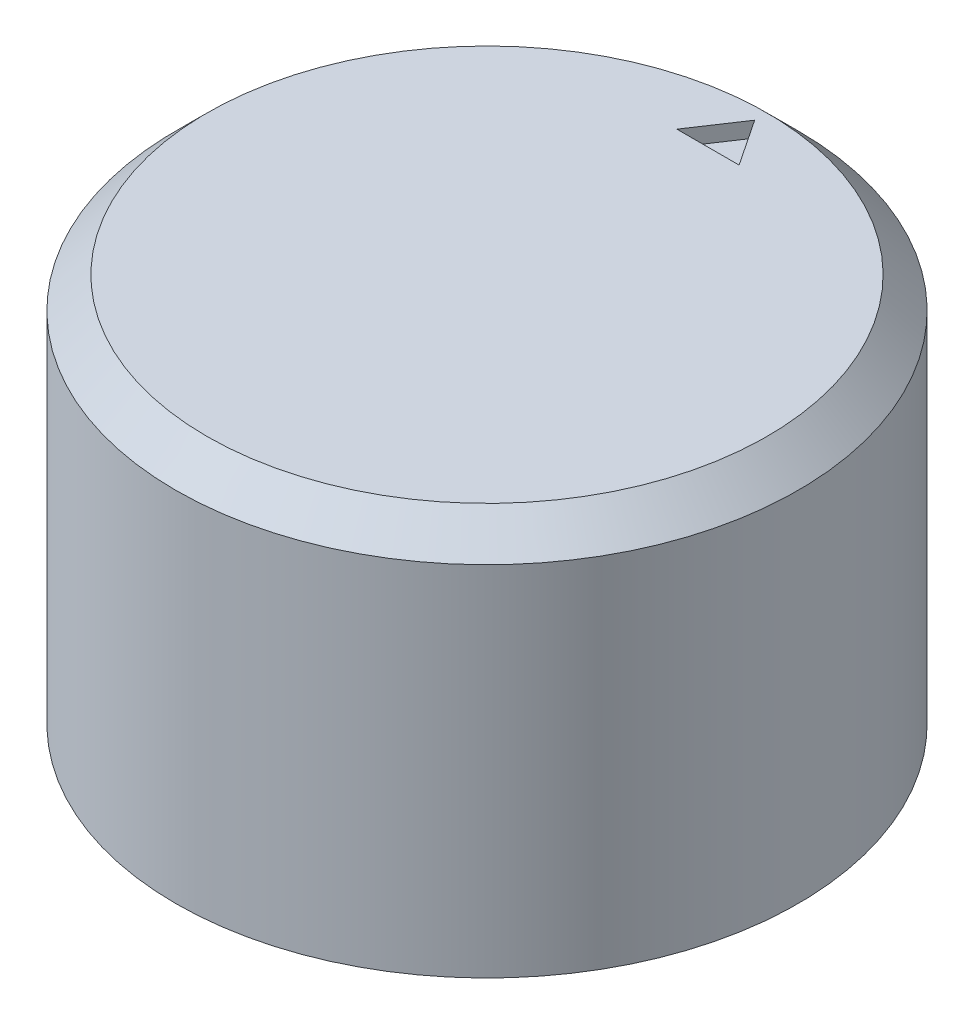
ISO-10303-21;
HEADER;
FILE_DESCRIPTION(('STEP AP214'),'2;1');
FILE_NAME('part.step','',(''),(''),'','','');
FILE_SCHEMA(('AUTOMOTIVE_DESIGN { 1 0 10303 214 1 1 1 1 }'));
ENDSEC;
DATA;
#1=APPLICATION_CONTEXT('core data for automotive mechanical design processes');
#2=APPLICATION_PROTOCOL_DEFINITION('international standard','automotive_design',2000,#1);
#3=PRODUCT_CONTEXT('',#1,'mechanical');
#4=PRODUCT('Part','Part','',(#3));
#5=PRODUCT_RELATED_PRODUCT_CATEGORY('part','',(#4));
#6=PRODUCT_DEFINITION_FORMATION('','',#4);
#7=PRODUCT_DEFINITION_CONTEXT('part definition',#1,'design');
#8=PRODUCT_DEFINITION('design','',#6,#7);
#9=PRODUCT_DEFINITION_SHAPE('','',#8);
#10=(LENGTH_UNIT() NAMED_UNIT(*) SI_UNIT(.MILLI.,.METRE.));
#11=(NAMED_UNIT(*) PLANE_ANGLE_UNIT() SI_UNIT($,.RADIAN.));
#12=(NAMED_UNIT(*) SI_UNIT($,.STERADIAN.) SOLID_ANGLE_UNIT());
#13=UNCERTAINTY_MEASURE_WITH_UNIT(LENGTH_MEASURE(1.E-05),#10,'distance_accuracy_value','');
#14=(GEOMETRIC_REPRESENTATION_CONTEXT(3) GLOBAL_UNCERTAINTY_ASSIGNED_CONTEXT((#13)) GLOBAL_UNIT_ASSIGNED_CONTEXT((#10,
#11,#12)) REPRESENTATION_CONTEXT('',''));
#15=CARTESIAN_POINT('',(0.,0.,0.));
#16=DIRECTION('',(0.,0.,1.));
#17=DIRECTION('',(1.,0.,0.));
#18=AXIS2_PLACEMENT_3D('',#15,#16,#17);
#19=CARTESIAN_POINT('',(0.,12.5,0.));
#20=DIRECTION('',(0.,-1.,0.));
#21=DIRECTION('',(0.,0.,-1.));
#22=AXIS2_PLACEMENT_3D('',#19,#20,#21);
#23=CYLINDRICAL_SURFACE('',#22,10.);
#24=CARTESIAN_POINT('',(0.,11.5,0.));
#25=DIRECTION('',(0.,1.,0.));
#26=DIRECTION('',(0.,0.,1.));
#27=AXIS2_PLACEMENT_3D('',#24,#25,#26);
#28=CIRCLE('',#27,10.);
#29=CARTESIAN_POINT('',(0.,11.5,10.));
#30=VERTEX_POINT('',#29);
#31=EDGE_CURVE('E11',#30,#30,#28,.F.);
#32=ORIENTED_EDGE('',*,*,#31,.T.);
#33=EDGE_LOOP('',(#32));
#34=FACE_BOUND('',#33,.T.);
#35=CARTESIAN_POINT('',(0.,0.,0.));
#36=DIRECTION('',(0.,1.,0.));
#37=DIRECTION('',(0.,0.,1.));
#38=AXIS2_PLACEMENT_3D('',#35,#36,#37);
#39=CIRCLE('',#38,10.);
#40=CARTESIAN_POINT('',(0.,0.,10.));
#41=VERTEX_POINT('',#40);
#42=EDGE_CURVE('E149',#41,#41,#39,.T.);
#43=ORIENTED_EDGE('',*,*,#42,.T.);
#44=EDGE_LOOP('',(#43));
#45=FACE_BOUND('',#44,.T.);
#46=ADVANCED_FACE('F44',(#34,#45),#23,.T.);
#47=CARTESIAN_POINT('',(0.,12.5,0.));
#48=DIRECTION('',(0.,1.,0.));
#49=DIRECTION('',(0.,0.,1.));
#50=AXIS2_PLACEMENT_3D('',#47,#48,#49);
#51=PLANE('',#50);
#52=CARTESIAN_POINT('',(0.,12.5,0.));
#53=DIRECTION('',(0.,1.,0.));
#54=DIRECTION('',(0.,0.,1.));
#55=AXIS2_PLACEMENT_3D('',#52,#53,#54);
#56=CIRCLE('',#55,8.99999999999999);
#57=CARTESIAN_POINT('',(0.,12.5,8.99999999999999));
#58=VERTEX_POINT('',#57);
#59=EDGE_CURVE('E54',#58,#58,#56,.T.);
#60=ORIENTED_EDGE('',*,*,#59,.T.);
#61=EDGE_LOOP('',(#60));
#62=FACE_BOUND('',#61,.T.);
#63=DIRECTION('',(1.,0.,0.));
#64=VECTOR('',#63,1.);
#65=CARTESIAN_POINT('',(1.,12.5,-7.1));
#66=LINE('',#65,#64);
#67=CARTESIAN_POINT('',(-1.,12.5,-7.1));
#68=VERTEX_POINT('',#67);
#69=CARTESIAN_POINT('',(1.,12.5,-7.1));
#70=VERTEX_POINT('',#69);
#71=EDGE_CURVE('E61',#68,#70,#66,.T.);
#72=ORIENTED_EDGE('',*,*,#71,.F.);
#73=DIRECTION('',(-0.554700196225229,0.,0.832050294337844));
#74=VECTOR('',#73,1.);
#75=CARTESIAN_POINT('',(-1.,12.5,-7.1));
#76=LINE('',#75,#74);
#77=CARTESIAN_POINT('',(0.,12.5,-8.6));
#78=VERTEX_POINT('',#77);
#79=EDGE_CURVE('E113',#78,#68,#76,.T.);
#80=ORIENTED_EDGE('',*,*,#79,.F.);
#81=DIRECTION('',(-0.554700196225229,0.,-0.832050294337844));
#82=VECTOR('',#81,1.);
#83=CARTESIAN_POINT('',(0.,12.5,-8.6));
#84=LINE('',#83,#82);
#85=EDGE_CURVE('E117',#70,#78,#84,.T.);
#86=ORIENTED_EDGE('',*,*,#85,.F.);
#87=EDGE_LOOP('',(#72,#80,#86));
#88=FACE_BOUND('',#87,.T.);
#89=ADVANCED_FACE('F158',(#62,#88),#51,.T.);
#90=CARTESIAN_POINT('',(0.,0.,0.));
#91=DIRECTION('',(0.,1.,0.));
#92=DIRECTION('',(0.,0.,1.));
#93=AXIS2_PLACEMENT_3D('',#90,#91,#92);
#94=PLANE('',#93);
#95=DIRECTION('',(-1.,0.,0.));
#96=VECTOR('',#95,1.);
#97=CARTESIAN_POINT('',(-2.59807621135332,0.,1.5));
#98=LINE('',#97,#96);
#99=CARTESIAN_POINT('',(2.59807621135332,0.,1.5));
#100=VERTEX_POINT('',#99);
#101=CARTESIAN_POINT('',(-2.59807621135332,0.,1.5));
#102=VERTEX_POINT('',#101);
#103=EDGE_CURVE('E136',#100,#102,#98,.T.);
#104=ORIENTED_EDGE('',*,*,#103,.F.);
#105=CARTESIAN_POINT('',(0.,0.,0.));
#106=DIRECTION('',(0.,-1.,0.));
#107=DIRECTION('',(0.,0.,-1.));
#108=AXIS2_PLACEMENT_3D('',#105,#106,#107);
#109=CIRCLE('',#108,3.);
#110=EDGE_CURVE('E69',#102,#100,#109,.T.);
#111=ORIENTED_EDGE('',*,*,#110,.F.);
#112=EDGE_LOOP('',(#104,#111));
#113=FACE_BOUND('',#112,.T.);
#114=ORIENTED_EDGE('',*,*,#42,.F.);
#115=EDGE_LOOP('',(#114));
#116=FACE_BOUND('',#115,.T.);
#117=ADVANCED_FACE('F174',(#113,#116),#94,.F.);
#118=CARTESIAN_POINT('',(0.,10.,0.));
#119=DIRECTION('',(0.,-1.,0.));
#120=DIRECTION('',(0.,0.,-1.));
#121=AXIS2_PLACEMENT_3D('',#118,#119,#120);
#122=CYLINDRICAL_SURFACE('',#121,3.);
#123=ORIENTED_EDGE('',*,*,#110,.T.);
#124=DIRECTION('',(0.,-1.,0.));
#125=VECTOR('',#124,1.);
#126=CARTESIAN_POINT('',(2.59807621135332,10.,1.5));
#127=LINE('',#126,#125);
#128=CARTESIAN_POINT('',(2.59807621135332,10.,1.5));
#129=VERTEX_POINT('',#128);
#130=EDGE_CURVE('E140',#129,#100,#127,.T.);
#131=ORIENTED_EDGE('',*,*,#130,.F.);
#132=CARTESIAN_POINT('',(0.,10.,0.));
#133=DIRECTION('',(0.,-1.,0.));
#134=DIRECTION('',(0.,0.,-1.));
#135=AXIS2_PLACEMENT_3D('',#132,#133,#134);
#136=CIRCLE('',#135,3.);
#137=CARTESIAN_POINT('',(-2.59807621135332,10.,1.5));
#138=VERTEX_POINT('',#137);
#139=EDGE_CURVE('E131',#138,#129,#136,.T.);
#140=ORIENTED_EDGE('',*,*,#139,.F.);
#141=DIRECTION('',(0.,-1.,0.));
#142=VECTOR('',#141,1.);
#143=CARTESIAN_POINT('',(-2.59807621135332,10.,1.5));
#144=LINE('',#143,#142);
#145=EDGE_CURVE('E146',#138,#102,#144,.T.);
#146=ORIENTED_EDGE('',*,*,#145,.T.);
#147=EDGE_LOOP('',(#123,#131,#140,#146));
#148=FACE_BOUND('',#147,.T.);
#149=ADVANCED_FACE('F179',(#148),#122,.F.);
#150=CARTESIAN_POINT('',(-2.59807621135332,10.,1.5));
#151=DIRECTION('',(0.,0.,1.));
#152=DIRECTION('',(1.,0.,0.));
#153=AXIS2_PLACEMENT_3D('',#150,#151,#152);
#154=PLANE('',#153);
#155=ORIENTED_EDGE('',*,*,#103,.T.);
#156=ORIENTED_EDGE('',*,*,#145,.F.);
#157=DIRECTION('',(-1.,0.,0.));
#158=VECTOR('',#157,1.);
#159=CARTESIAN_POINT('',(-2.59807621135332,10.,1.5));
#160=LINE('',#159,#158);
#161=EDGE_CURVE('E135',#129,#138,#160,.T.);
#162=ORIENTED_EDGE('',*,*,#161,.F.);
#163=ORIENTED_EDGE('',*,*,#130,.T.);
#164=EDGE_LOOP('',(#155,#156,#162,#163));
#165=FACE_BOUND('',#164,.T.);
#166=ADVANCED_FACE('F184',(#165),#154,.F.);
#167=CARTESIAN_POINT('',(0.,10.,0.));
#168=DIRECTION('',(0.,-1.,0.));
#169=DIRECTION('',(0.,0.,-1.));
#170=AXIS2_PLACEMENT_3D('',#167,#168,#169);
#171=PLANE('',#170);
#172=ORIENTED_EDGE('',*,*,#139,.T.);
#173=ORIENTED_EDGE('',*,*,#161,.T.);
#174=EDGE_LOOP('',(#172,#173));
#175=FACE_BOUND('',#174,.T.);
#176=ADVANCED_FACE('F187',(#175),#171,.T.);
#177=CARTESIAN_POINT('',(1.,12.,-7.1));
#178=DIRECTION('',(0.,0.,1.));
#179=DIRECTION('',(1.,0.,0.));
#180=AXIS2_PLACEMENT_3D('',#177,#178,#179);
#181=PLANE('',#180);
#182=ORIENTED_EDGE('',*,*,#71,.T.);
#183=DIRECTION('',(0.,1.,0.));
#184=VECTOR('',#183,1.);
#185=CARTESIAN_POINT('',(1.,12.,-7.1));
#186=LINE('',#185,#184);
#187=CARTESIAN_POINT('',(1.,12.,-7.1));
#188=VERTEX_POINT('',#187);
#189=EDGE_CURVE('E91',#188,#70,#186,.T.);
#190=ORIENTED_EDGE('',*,*,#189,.F.);
#191=DIRECTION('',(1.,0.,0.));
#192=VECTOR('',#191,1.);
#193=CARTESIAN_POINT('',(1.,12.,-7.1));
#194=LINE('',#193,#192);
#195=CARTESIAN_POINT('',(-1.,12.,-7.1));
#196=VERTEX_POINT('',#195);
#197=EDGE_CURVE('E95',#196,#188,#194,.T.);
#198=ORIENTED_EDGE('',*,*,#197,.F.);
#199=DIRECTION('',(0.,1.,0.));
#200=VECTOR('',#199,1.);
#201=CARTESIAN_POINT('',(-1.,12.,-7.1));
#202=LINE('',#201,#200);
#203=EDGE_CURVE('E126',#196,#68,#202,.T.);
#204=ORIENTED_EDGE('',*,*,#203,.T.);
#205=EDGE_LOOP('',(#182,#190,#198,#204));
#206=FACE_BOUND('',#205,.T.);
#207=ADVANCED_FACE('F93',(#206),#181,.F.);
#208=CARTESIAN_POINT('',(-1.,12.,-7.1));
#209=DIRECTION('',(-0.832050294337844,0.,-0.554700196225229));
#210=DIRECTION('',(-0.554700196225229,0.,0.832050294337844));
#211=AXIS2_PLACEMENT_3D('',#208,#209,#210);
#212=PLANE('',#211);
#213=ORIENTED_EDGE('',*,*,#79,.T.);
#214=ORIENTED_EDGE('',*,*,#203,.F.);
#215=DIRECTION('',(-0.554700196225229,0.,0.832050294337844));
#216=VECTOR('',#215,1.);
#217=CARTESIAN_POINT('',(-1.,12.,-7.1));
#218=LINE('',#217,#216);
#219=CARTESIAN_POINT('',(0.,12.,-8.6));
#220=VERTEX_POINT('',#219);
#221=EDGE_CURVE('E102',#220,#196,#218,.T.);
#222=ORIENTED_EDGE('',*,*,#221,.F.);
#223=DIRECTION('',(0.,1.,0.));
#224=VECTOR('',#223,1.);
#225=CARTESIAN_POINT('',(0.,12.,-8.6));
#226=LINE('',#225,#224);
#227=EDGE_CURVE('E101',#220,#78,#226,.T.);
#228=ORIENTED_EDGE('',*,*,#227,.T.);
#229=EDGE_LOOP('',(#213,#214,#222,#228));
#230=FACE_BOUND('',#229,.T.);
#231=ADVANCED_FACE('F194',(#230),#212,.F.);
#232=CARTESIAN_POINT('',(0.,12.,-8.6));
#233=DIRECTION('',(0.832050294337844,0.,-0.554700196225229));
#234=DIRECTION('',(-0.554700196225229,0.,-0.832050294337844));
#235=AXIS2_PLACEMENT_3D('',#232,#233,#234);
#236=PLANE('',#235);
#237=ORIENTED_EDGE('',*,*,#85,.T.);
#238=ORIENTED_EDGE('',*,*,#227,.F.);
#239=DIRECTION('',(-0.554700196225229,0.,-0.832050294337844));
#240=VECTOR('',#239,1.);
#241=CARTESIAN_POINT('',(0.,12.,-8.6));
#242=LINE('',#241,#240);
#243=EDGE_CURVE('E105',#188,#220,#242,.T.);
#244=ORIENTED_EDGE('',*,*,#243,.F.);
#245=ORIENTED_EDGE('',*,*,#189,.T.);
#246=EDGE_LOOP('',(#237,#238,#244,#245));
#247=FACE_BOUND('',#246,.T.);
#248=ADVANCED_FACE('F106',(#247),#236,.F.);
#249=CARTESIAN_POINT('',(0.,12.,0.));
#250=DIRECTION('',(0.,-1.,0.));
#251=DIRECTION('',(0.,0.,-1.));
#252=AXIS2_PLACEMENT_3D('',#249,#250,#251);
#253=PLANE('',#252);
#254=ORIENTED_EDGE('',*,*,#197,.T.);
#255=ORIENTED_EDGE('',*,*,#243,.T.);
#256=ORIENTED_EDGE('',*,*,#221,.T.);
#257=EDGE_LOOP('',(#254,#255,#256));
#258=FACE_BOUND('',#257,.T.);
#259=ADVANCED_FACE('F111',(#258),#253,.F.);
#260=CARTESIAN_POINT('',(0.,12.5,0.));
#261=DIRECTION('',(0.,-1.,0.));
#262=DIRECTION('',(0.,0.,-1.));
#263=AXIS2_PLACEMENT_3D('',#260,#261,#262);
#264=CONICAL_SURFACE('',#263,8.99999999999999,0.785398163397448);
#265=ORIENTED_EDGE('',*,*,#31,.F.);
#266=EDGE_LOOP('',(#265));
#267=FACE_BOUND('',#266,.T.);
#268=ORIENTED_EDGE('',*,*,#59,.F.);
#269=EDGE_LOOP('',(#268));
#270=FACE_BOUND('',#269,.T.);
#271=ADVANCED_FACE('F47',(#267,#270),#264,.T.);
#272=CLOSED_SHELL('',(#46,#89,#117,#149,#166,#176,#207,#231,#248,#259,#271));
#273=MANIFOLD_SOLID_BREP('B2',#272);
#274=ADVANCED_BREP_SHAPE_REPRESENTATION('',(#18,#273),#14);
#275=SHAPE_DEFINITION_REPRESENTATION(#9,#274);
ENDSEC;
END-ISO-10303-21;
